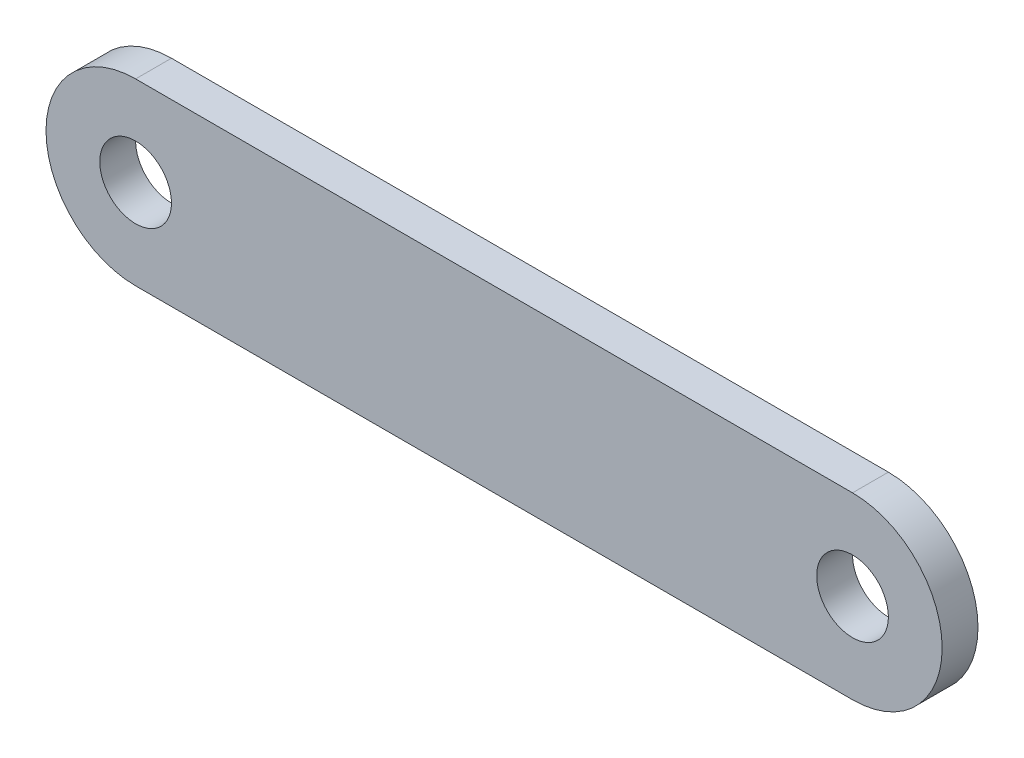
ISO-10303-21;
HEADER;
FILE_DESCRIPTION(('STEP AP214'),'2;1');
FILE_NAME('part.step','',(''),(''),'','','');
FILE_SCHEMA(('AUTOMOTIVE_DESIGN { 1 0 10303 214 1 1 1 1 }'));
ENDSEC;
DATA;
#1=APPLICATION_CONTEXT('core data for automotive mechanical design processes');
#2=APPLICATION_PROTOCOL_DEFINITION('international standard','automotive_design',2000,#1);
#3=PRODUCT_CONTEXT('',#1,'mechanical');
#4=PRODUCT('Part','Part','',(#3));
#5=PRODUCT_RELATED_PRODUCT_CATEGORY('part','',(#4));
#6=PRODUCT_DEFINITION_FORMATION('','',#4);
#7=PRODUCT_DEFINITION_CONTEXT('part definition',#1,'design');
#8=PRODUCT_DEFINITION('design','',#6,#7);
#9=PRODUCT_DEFINITION_SHAPE('','',#8);
#10=(LENGTH_UNIT() NAMED_UNIT(*) SI_UNIT(.MILLI.,.METRE.));
#11=(NAMED_UNIT(*) PLANE_ANGLE_UNIT() SI_UNIT($,.RADIAN.));
#12=(NAMED_UNIT(*) SI_UNIT($,.STERADIAN.) SOLID_ANGLE_UNIT());
#13=UNCERTAINTY_MEASURE_WITH_UNIT(LENGTH_MEASURE(1.E-05),#10,'distance_accuracy_value','');
#14=(GEOMETRIC_REPRESENTATION_CONTEXT(3) GLOBAL_UNCERTAINTY_ASSIGNED_CONTEXT((#13)) GLOBAL_UNIT_ASSIGNED_CONTEXT((#10,
#11,#12)) REPRESENTATION_CONTEXT('',''));
#15=CARTESIAN_POINT('',(0.,0.,0.));
#16=DIRECTION('',(0.,0.,1.));
#17=DIRECTION('',(1.,0.,0.));
#18=AXIS2_PLACEMENT_3D('',#15,#16,#17);
#19=CARTESIAN_POINT('',(0.,-25.,10.));
#20=DIRECTION('',(0.,1.,0.));
#21=DIRECTION('',(-1.,0.,0.));
#22=AXIS2_PLACEMENT_3D('',#19,#20,#21);
#23=PLANE('',#22);
#24=DIRECTION('',(1.,0.,0.));
#25=VECTOR('',#24,1.);
#26=CARTESIAN_POINT('',(0.,-25.,0.));
#27=LINE('',#26,#25);
#28=CARTESIAN_POINT('',(0.,-25.,0.));
#29=VERTEX_POINT('',#28);
#30=CARTESIAN_POINT('',(200.,-25.,0.));
#31=VERTEX_POINT('',#30);
#32=EDGE_CURVE('E106',#29,#31,#27,.T.);
#33=ORIENTED_EDGE('',*,*,#32,.T.);
#34=DIRECTION('',(0.,0.,-1.));
#35=VECTOR('',#34,1.);
#36=CARTESIAN_POINT('',(200.,-25.,10.));
#37=LINE('',#36,#35);
#38=CARTESIAN_POINT('',(200.,-25.,10.));
#39=VERTEX_POINT('',#38);
#40=EDGE_CURVE('E11',#39,#31,#37,.T.);
#41=ORIENTED_EDGE('',*,*,#40,.F.);
#42=DIRECTION('',(1.,0.,0.));
#43=VECTOR('',#42,1.);
#44=CARTESIAN_POINT('',(0.,-25.,10.));
#45=LINE('',#44,#43);
#46=CARTESIAN_POINT('',(0.,-25.,10.));
#47=VERTEX_POINT('',#46);
#48=EDGE_CURVE('E87',#47,#39,#45,.T.);
#49=ORIENTED_EDGE('',*,*,#48,.F.);
#50=DIRECTION('',(0.,0.,-1.));
#51=VECTOR('',#50,1.);
#52=CARTESIAN_POINT('',(0.,-25.,10.));
#53=LINE('',#52,#51);
#54=EDGE_CURVE('E102',#47,#29,#53,.T.);
#55=ORIENTED_EDGE('',*,*,#54,.T.);
#56=EDGE_LOOP('',(#33,#41,#49,#55));
#57=FACE_BOUND('',#56,.T.);
#58=ADVANCED_FACE('F39',(#57),#23,.F.);
#59=CARTESIAN_POINT('',(200.,0.,10.));
#60=DIRECTION('',(0.,0.,-1.));
#61=DIRECTION('',(-1.,0.,0.));
#62=AXIS2_PLACEMENT_3D('',#59,#60,#61);
#63=CYLINDRICAL_SURFACE('',#62,25.);
#64=CARTESIAN_POINT('',(200.,0.,0.));
#65=DIRECTION('',(0.,0.,1.));
#66=DIRECTION('',(1.,0.,0.));
#67=AXIS2_PLACEMENT_3D('',#64,#65,#66);
#68=CIRCLE('',#67,25.);
#69=CARTESIAN_POINT('',(200.,25.,0.));
#70=VERTEX_POINT('',#69);
#71=EDGE_CURVE('E93',#31,#70,#68,.T.);
#72=ORIENTED_EDGE('',*,*,#71,.T.);
#73=DIRECTION('',(0.,0.,-1.));
#74=VECTOR('',#73,1.);
#75=CARTESIAN_POINT('',(200.,25.,10.));
#76=LINE('',#75,#74);
#77=CARTESIAN_POINT('',(200.,25.,10.));
#78=VERTEX_POINT('',#77);
#79=EDGE_CURVE('E48',#78,#70,#76,.T.);
#80=ORIENTED_EDGE('',*,*,#79,.F.);
#81=CARTESIAN_POINT('',(200.,0.,10.));
#82=DIRECTION('',(0.,0.,1.));
#83=DIRECTION('',(1.,0.,0.));
#84=AXIS2_PLACEMENT_3D('',#81,#82,#83);
#85=CIRCLE('',#84,25.);
#86=EDGE_CURVE('E82',#39,#78,#85,.T.);
#87=ORIENTED_EDGE('',*,*,#86,.F.);
#88=ORIENTED_EDGE('',*,*,#40,.T.);
#89=EDGE_LOOP('',(#72,#80,#87,#88));
#90=FACE_BOUND('',#89,.T.);
#91=ADVANCED_FACE('F92',(#90),#63,.T.);
#92=CARTESIAN_POINT('',(0.,25.,10.));
#93=DIRECTION('',(0.,1.,0.));
#94=DIRECTION('',(-1.,0.,0.));
#95=AXIS2_PLACEMENT_3D('',#92,#93,#94);
#96=PLANE('',#95);
#97=DIRECTION('',(1.,0.,0.));
#98=VECTOR('',#97,1.);
#99=CARTESIAN_POINT('',(0.,25.,0.));
#100=LINE('',#99,#98);
#101=CARTESIAN_POINT('',(0.,25.,0.));
#102=VERTEX_POINT('',#101);
#103=EDGE_CURVE('E113',#102,#70,#100,.T.);
#104=ORIENTED_EDGE('',*,*,#103,.F.);
#105=DIRECTION('',(0.,0.,-1.));
#106=VECTOR('',#105,1.);
#107=CARTESIAN_POINT('',(0.,25.,10.));
#108=LINE('',#107,#106);
#109=CARTESIAN_POINT('',(0.,25.,10.));
#110=VERTEX_POINT('',#109);
#111=EDGE_CURVE('E72',#110,#102,#108,.T.);
#112=ORIENTED_EDGE('',*,*,#111,.F.);
#113=DIRECTION('',(1.,0.,0.));
#114=VECTOR('',#113,1.);
#115=CARTESIAN_POINT('',(0.,25.,10.));
#116=LINE('',#115,#114);
#117=EDGE_CURVE('E85',#110,#78,#116,.T.);
#118=ORIENTED_EDGE('',*,*,#117,.T.);
#119=ORIENTED_EDGE('',*,*,#79,.T.);
#120=EDGE_LOOP('',(#104,#112,#118,#119));
#121=FACE_BOUND('',#120,.T.);
#122=ADVANCED_FACE('F98',(#121),#96,.T.);
#123=CARTESIAN_POINT('',(0.,0.,10.));
#124=DIRECTION('',(0.,0.,-1.));
#125=DIRECTION('',(-1.,0.,0.));
#126=AXIS2_PLACEMENT_3D('',#123,#124,#125);
#127=CYLINDRICAL_SURFACE('',#126,25.);
#128=CARTESIAN_POINT('',(0.,0.,0.));
#129=DIRECTION('',(0.,0.,1.));
#130=DIRECTION('',(1.,0.,0.));
#131=AXIS2_PLACEMENT_3D('',#128,#129,#130);
#132=CIRCLE('',#131,25.);
#133=EDGE_CURVE('E75',#102,#29,#132,.T.);
#134=ORIENTED_EDGE('',*,*,#133,.T.);
#135=ORIENTED_EDGE('',*,*,#54,.F.);
#136=CARTESIAN_POINT('',(0.,0.,10.));
#137=DIRECTION('',(0.,0.,1.));
#138=DIRECTION('',(1.,0.,0.));
#139=AXIS2_PLACEMENT_3D('',#136,#137,#138);
#140=CIRCLE('',#139,25.);
#141=EDGE_CURVE('E56',#110,#47,#140,.T.);
#142=ORIENTED_EDGE('',*,*,#141,.F.);
#143=ORIENTED_EDGE('',*,*,#111,.T.);
#144=EDGE_LOOP('',(#134,#135,#142,#143));
#145=FACE_BOUND('',#144,.T.);
#146=ADVANCED_FACE('F136',(#145),#127,.T.);
#147=CARTESIAN_POINT('',(200.,0.,10.));
#148=DIRECTION('',(0.,0.,1.));
#149=DIRECTION('',(1.,0.,0.));
#150=AXIS2_PLACEMENT_3D('',#147,#148,#149);
#151=PLANE('',#150);
#152=CARTESIAN_POINT('',(0.,0.,10.));
#153=DIRECTION('',(0.,0.,1.));
#154=DIRECTION('',(1.,0.,0.));
#155=AXIS2_PLACEMENT_3D('',#152,#153,#154);
#156=CIRCLE('',#155,10.);
#157=CARTESIAN_POINT('',(10.,0.,10.));
#158=VERTEX_POINT('',#157);
#159=EDGE_CURVE('E186',#158,#158,#156,.T.);
#160=ORIENTED_EDGE('',*,*,#159,.F.);
#161=EDGE_LOOP('',(#160));
#162=FACE_BOUND('',#161,.T.);
#163=CARTESIAN_POINT('',(200.,0.,10.));
#164=DIRECTION('',(0.,0.,1.));
#165=DIRECTION('',(1.,0.,0.));
#166=AXIS2_PLACEMENT_3D('',#163,#164,#165);
#167=CIRCLE('',#166,10.);
#168=CARTESIAN_POINT('',(210.,0.,10.));
#169=VERTEX_POINT('',#168);
#170=EDGE_CURVE('E194',#169,#169,#167,.T.);
#171=ORIENTED_EDGE('',*,*,#170,.F.);
#172=EDGE_LOOP('',(#171));
#173=FACE_BOUND('',#172,.T.);
#174=ORIENTED_EDGE('',*,*,#48,.T.);
#175=ORIENTED_EDGE('',*,*,#86,.T.);
#176=ORIENTED_EDGE('',*,*,#117,.F.);
#177=ORIENTED_EDGE('',*,*,#141,.T.);
#178=EDGE_LOOP('',(#174,#175,#176,#177));
#179=FACE_BOUND('',#178,.T.);
#180=ADVANCED_FACE('F83',(#162,#173,#179),#151,.T.);
#181=CARTESIAN_POINT('',(200.,0.,0.));
#182=DIRECTION('',(0.,0.,1.));
#183=DIRECTION('',(1.,0.,0.));
#184=AXIS2_PLACEMENT_3D('',#181,#182,#183);
#185=PLANE('',#184);
#186=CARTESIAN_POINT('',(0.,0.,0.));
#187=DIRECTION('',(0.,0.,1.));
#188=DIRECTION('',(1.,0.,0.));
#189=AXIS2_PLACEMENT_3D('',#186,#187,#188);
#190=CIRCLE('',#189,10.);
#191=CARTESIAN_POINT('',(10.,0.,0.));
#192=VERTEX_POINT('',#191);
#193=EDGE_CURVE('E110',#192,#192,#190,.T.);
#194=ORIENTED_EDGE('',*,*,#193,.T.);
#195=EDGE_LOOP('',(#194));
#196=FACE_BOUND('',#195,.T.);
#197=CARTESIAN_POINT('',(200.,0.,0.));
#198=DIRECTION('',(0.,0.,1.));
#199=DIRECTION('',(1.,0.,0.));
#200=AXIS2_PLACEMENT_3D('',#197,#198,#199);
#201=CIRCLE('',#200,10.);
#202=CARTESIAN_POINT('',(210.,0.,0.));
#203=VERTEX_POINT('',#202);
#204=EDGE_CURVE('E188',#203,#203,#201,.T.);
#205=ORIENTED_EDGE('',*,*,#204,.T.);
#206=EDGE_LOOP('',(#205));
#207=FACE_BOUND('',#206,.T.);
#208=ORIENTED_EDGE('',*,*,#32,.F.);
#209=ORIENTED_EDGE('',*,*,#133,.F.);
#210=ORIENTED_EDGE('',*,*,#103,.T.);
#211=ORIENTED_EDGE('',*,*,#71,.F.);
#212=EDGE_LOOP('',(#208,#209,#210,#211));
#213=FACE_BOUND('',#212,.T.);
#214=ADVANCED_FACE('F124',(#196,#207,#213),#185,.F.);
#215=CARTESIAN_POINT('',(200.,0.,0.));
#216=DIRECTION('',(0.,0.,1.));
#217=DIRECTION('',(1.,0.,0.));
#218=AXIS2_PLACEMENT_3D('',#215,#216,#217);
#219=CYLINDRICAL_SURFACE('',#218,10.);
#220=ORIENTED_EDGE('',*,*,#204,.F.);
#221=EDGE_LOOP('',(#220));
#222=FACE_BOUND('',#221,.T.);
#223=ORIENTED_EDGE('',*,*,#170,.T.);
#224=EDGE_LOOP('',(#223));
#225=FACE_BOUND('',#224,.T.);
#226=ADVANCED_FACE('F126',(#222,#225),#219,.F.);
#227=CARTESIAN_POINT('',(0.,0.,0.));
#228=DIRECTION('',(0.,0.,1.));
#229=DIRECTION('',(1.,0.,0.));
#230=AXIS2_PLACEMENT_3D('',#227,#228,#229);
#231=CYLINDRICAL_SURFACE('',#230,10.);
#232=ORIENTED_EDGE('',*,*,#193,.F.);
#233=EDGE_LOOP('',(#232));
#234=FACE_BOUND('',#233,.T.);
#235=ORIENTED_EDGE('',*,*,#159,.T.);
#236=EDGE_LOOP('',(#235));
#237=FACE_BOUND('',#236,.T.);
#238=ADVANCED_FACE('F133',(#234,#237),#231,.F.);
#239=CLOSED_SHELL('',(#58,#91,#122,#146,#180,#214,#226,#238));
#240=MANIFOLD_SOLID_BREP('B2',#239);
#241=ADVANCED_BREP_SHAPE_REPRESENTATION('',(#18,#240),#14);
#242=SHAPE_DEFINITION_REPRESENTATION(#9,#241);
ENDSEC;
END-ISO-10303-21;
